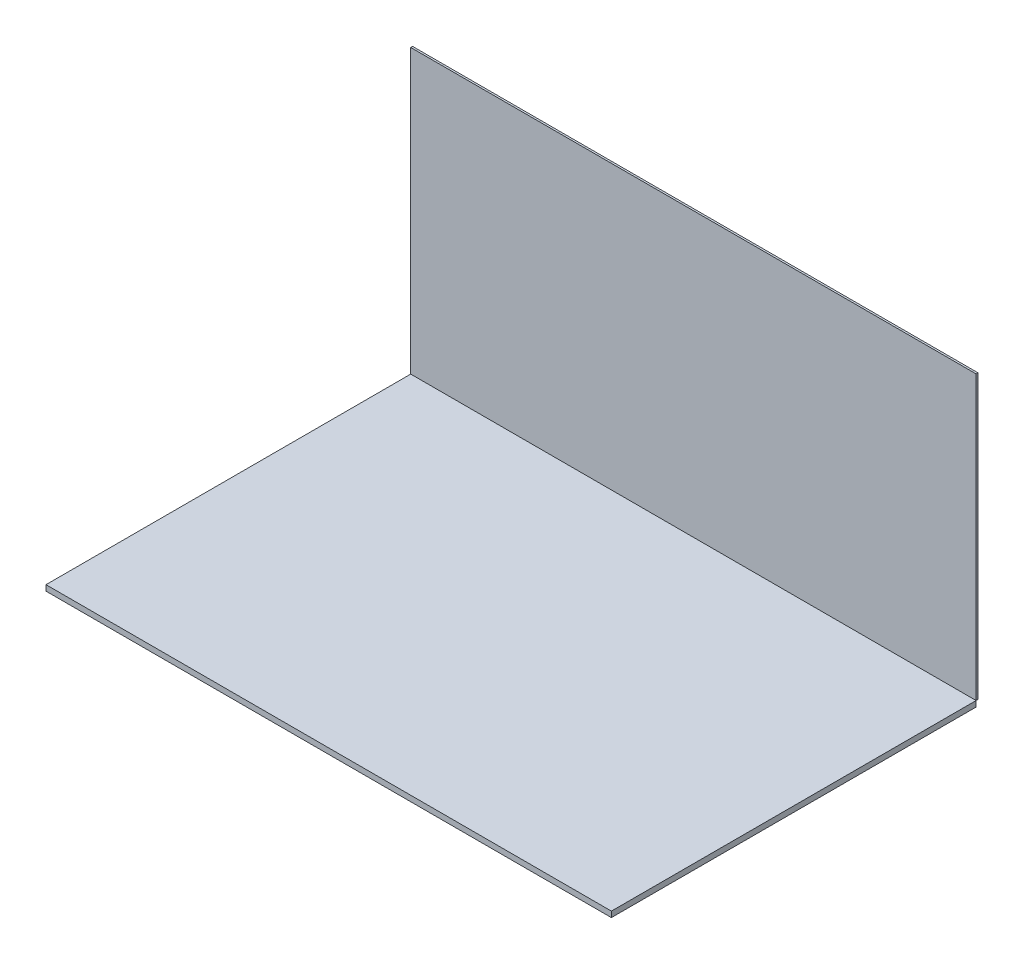
ISO-10303-21;
HEADER;
FILE_DESCRIPTION(('STEP AP214'),'2;1');
FILE_NAME('part.step','',(''),(''),'','','');
FILE_SCHEMA(('AUTOMOTIVE_DESIGN { 1 0 10303 214 1 1 1 1 }'));
ENDSEC;
DATA;
#1=APPLICATION_CONTEXT('core data for automotive mechanical design processes');
#2=APPLICATION_PROTOCOL_DEFINITION('international standard','automotive_design',2000,#1);
#3=PRODUCT_CONTEXT('',#1,'mechanical');
#4=PRODUCT('Part','Part','',(#3));
#5=PRODUCT_RELATED_PRODUCT_CATEGORY('part','',(#4));
#6=PRODUCT_DEFINITION_FORMATION('','',#4);
#7=PRODUCT_DEFINITION_CONTEXT('part definition',#1,'design');
#8=PRODUCT_DEFINITION('design','',#6,#7);
#9=PRODUCT_DEFINITION_SHAPE('','',#8);
#10=(LENGTH_UNIT() NAMED_UNIT(*) SI_UNIT(.MILLI.,.METRE.));
#11=(NAMED_UNIT(*) PLANE_ANGLE_UNIT() SI_UNIT($,.RADIAN.));
#12=(NAMED_UNIT(*) SI_UNIT($,.STERADIAN.) SOLID_ANGLE_UNIT());
#13=UNCERTAINTY_MEASURE_WITH_UNIT(LENGTH_MEASURE(1.E-05),#10,'distance_accuracy_value','');
#14=(GEOMETRIC_REPRESENTATION_CONTEXT(3) GLOBAL_UNCERTAINTY_ASSIGNED_CONTEXT((#13)) GLOBAL_UNIT_ASSIGNED_CONTEXT((#10,
#11,#12)) REPRESENTATION_CONTEXT('',''));
#15=CARTESIAN_POINT('',(0.,0.,0.));
#16=DIRECTION('',(0.,0.,1.));
#17=DIRECTION('',(1.,0.,0.));
#18=AXIS2_PLACEMENT_3D('',#15,#16,#17);
#19=CARTESIAN_POINT('',(15.512687992324,38.862,-20.3499821718743));
#20=DIRECTION('',(0.,0.,1.));
#21=DIRECTION('',(1.,0.,0.));
#22=AXIS2_PLACEMENT_3D('',#19,#20,#21);
#23=PLANE('',#22);
#24=DIRECTION('',(1.,0.,0.));
#25=VECTOR('',#24,1.);
#26=CARTESIAN_POINT('',(15.512687992324,0.762,-20.3499821718743));
#27=LINE('',#26,#25);
#28=CARTESIAN_POINT('',(15.512687992324,0.762,-20.3499821718743));
#29=VERTEX_POINT('',#28);
#30=CARTESIAN_POINT('',(-60.6405076063575,0.762,-20.3499821718743));
#31=VERTEX_POINT('',#30);
#32=EDGE_CURVE('E113',#29,#31,#27,.F.);
#33=ORIENTED_EDGE('',*,*,#32,.T.);
#34=DIRECTION('',(0.,-1.,0.));
#35=VECTOR('',#34,1.);
#36=CARTESIAN_POINT('',(-60.6405076063575,38.862,-20.3499821718743));
#37=LINE('',#36,#35);
#38=CARTESIAN_POINT('',(-60.6405076063575,38.862,-20.3499821718743));
#39=VERTEX_POINT('',#38);
#40=EDGE_CURVE('E12',#39,#31,#37,.T.);
#41=ORIENTED_EDGE('',*,*,#40,.F.);
#42=DIRECTION('',(1.,0.,0.));
#43=VECTOR('',#42,1.);
#44=CARTESIAN_POINT('',(15.512687992324,38.862,-20.3499821718743));
#45=LINE('',#44,#43);
#46=CARTESIAN_POINT('',(15.512687992324,38.862,-20.3499821718743));
#47=VERTEX_POINT('',#46);
#48=EDGE_CURVE('E90',#47,#39,#45,.F.);
#49=ORIENTED_EDGE('',*,*,#48,.F.);
#50=DIRECTION('',(0.,-1.,0.));
#51=VECTOR('',#50,1.);
#52=CARTESIAN_POINT('',(15.512687992324,38.862,-20.3499821718743));
#53=LINE('',#52,#51);
#54=EDGE_CURVE('E66',#47,#29,#53,.T.);
#55=ORIENTED_EDGE('',*,*,#54,.T.);
#56=EDGE_LOOP('',(#33,#41,#49,#55));
#57=FACE_BOUND('',#56,.T.);
#58=ADVANCED_FACE('F50',(#57),#23,.F.);
#59=CARTESIAN_POINT('',(-60.6405076063575,38.862,-20.0959821718743));
#60=DIRECTION('',(-1.,0.,0.));
#61=DIRECTION('',(0.,0.,1.));
#62=AXIS2_PLACEMENT_3D('',#59,#60,#61);
#63=PLANE('',#62);
#64=DIRECTION('',(0.,0.,-1.));
#65=VECTOR('',#64,1.);
#66=CARTESIAN_POINT('',(-60.6405076063575,0.762,-20.0959821718743));
#67=LINE('',#66,#65);
#68=CARTESIAN_POINT('',(-60.6405076063575,0.762,-20.0959821718743));
#69=VERTEX_POINT('',#68);
#70=EDGE_CURVE('E99',#69,#31,#67,.T.);
#71=ORIENTED_EDGE('',*,*,#70,.F.);
#72=DIRECTION('',(0.,-1.,0.));
#73=VECTOR('',#72,1.);
#74=CARTESIAN_POINT('',(-60.6405076063575,38.862,-20.0959821718743));
#75=LINE('',#74,#73);
#76=CARTESIAN_POINT('',(-60.6405076063575,38.862,-20.0959821718743));
#77=VERTEX_POINT('',#76);
#78=EDGE_CURVE('E58',#77,#69,#75,.T.);
#79=ORIENTED_EDGE('',*,*,#78,.F.);
#80=DIRECTION('',(0.,0.,-1.));
#81=VECTOR('',#80,1.);
#82=CARTESIAN_POINT('',(-60.6405076063575,38.862,-20.0959821718743));
#83=LINE('',#82,#81);
#84=EDGE_CURVE('E97',#77,#39,#83,.T.);
#85=ORIENTED_EDGE('',*,*,#84,.T.);
#86=ORIENTED_EDGE('',*,*,#40,.T.);
#87=EDGE_LOOP('',(#71,#79,#85,#86));
#88=FACE_BOUND('',#87,.T.);
#89=ADVANCED_FACE('F96',(#88),#63,.T.);
#90=CARTESIAN_POINT('',(15.512687992324,38.862,-20.0959821718743));
#91=DIRECTION('',(0.,0.,1.));
#92=DIRECTION('',(1.,0.,0.));
#93=AXIS2_PLACEMENT_3D('',#90,#91,#92);
#94=PLANE('',#93);
#95=DIRECTION('',(-1.,0.,0.));
#96=VECTOR('',#95,1.);
#97=CARTESIAN_POINT('',(15.512687992324,0.762,-20.0959821718743));
#98=LINE('',#97,#96);
#99=CARTESIAN_POINT('',(15.512687992324,0.762,-20.0959821718743));
#100=VERTEX_POINT('',#99);
#101=EDGE_CURVE('E116',#100,#69,#98,.T.);
#102=ORIENTED_EDGE('',*,*,#101,.F.);
#103=DIRECTION('',(0.,-1.,0.));
#104=VECTOR('',#103,1.);
#105=CARTESIAN_POINT('',(15.512687992324,38.862,-20.0959821718743));
#106=LINE('',#105,#104);
#107=CARTESIAN_POINT('',(15.512687992324,38.862,-20.0959821718743));
#108=VERTEX_POINT('',#107);
#109=EDGE_CURVE('E79',#108,#100,#106,.T.);
#110=ORIENTED_EDGE('',*,*,#109,.F.);
#111=DIRECTION('',(-1.,0.,0.));
#112=VECTOR('',#111,1.);
#113=CARTESIAN_POINT('',(15.512687992324,38.862,-20.0959821718743));
#114=LINE('',#113,#112);
#115=EDGE_CURVE('E105',#108,#77,#114,.T.);
#116=ORIENTED_EDGE('',*,*,#115,.T.);
#117=ORIENTED_EDGE('',*,*,#78,.T.);
#118=EDGE_LOOP('',(#102,#110,#116,#117));
#119=FACE_BOUND('',#118,.T.);
#120=ADVANCED_FACE('F107',(#119),#94,.T.);
#121=CARTESIAN_POINT('',(15.512687992324,38.862,-20.3499821718743));
#122=DIRECTION('',(1.,0.,0.));
#123=DIRECTION('',(0.,0.,-1.));
#124=AXIS2_PLACEMENT_3D('',#121,#122,#123);
#125=PLANE('',#124);
#126=DIRECTION('',(0.,0.,1.));
#127=VECTOR('',#126,1.);
#128=CARTESIAN_POINT('',(15.512687992324,0.762,-20.3499821718743));
#129=LINE('',#128,#127);
#130=EDGE_CURVE('E118',#29,#100,#129,.T.);
#131=ORIENTED_EDGE('',*,*,#130,.F.);
#132=ORIENTED_EDGE('',*,*,#54,.F.);
#133=DIRECTION('',(0.,0.,1.));
#134=VECTOR('',#133,1.);
#135=CARTESIAN_POINT('',(15.512687992324,38.862,-20.3499821718743));
#136=LINE('',#135,#134);
#137=EDGE_CURVE('E108',#47,#108,#136,.T.);
#138=ORIENTED_EDGE('',*,*,#137,.T.);
#139=ORIENTED_EDGE('',*,*,#109,.T.);
#140=EDGE_LOOP('',(#131,#132,#138,#139));
#141=FACE_BOUND('',#140,.T.);
#142=ADVANCED_FACE('F126',(#141),#125,.T.);
#143=CARTESIAN_POINT('',(0.,38.862,0.));
#144=DIRECTION('',(0.,1.,0.));
#145=DIRECTION('',(1.,0.,0.));
#146=AXIS2_PLACEMENT_3D('',#143,#144,#145);
#147=PLANE('',#146);
#148=ORIENTED_EDGE('',*,*,#48,.T.);
#149=ORIENTED_EDGE('',*,*,#84,.F.);
#150=ORIENTED_EDGE('',*,*,#115,.F.);
#151=ORIENTED_EDGE('',*,*,#137,.F.);
#152=EDGE_LOOP('',(#148,#149,#150,#151));
#153=FACE_BOUND('',#152,.T.);
#154=ADVANCED_FACE('F104',(#153),#147,.T.);
#155=CARTESIAN_POINT('',(0.,0.762,0.));
#156=DIRECTION('',(0.,1.,0.));
#157=DIRECTION('',(1.,0.,0.));
#158=AXIS2_PLACEMENT_3D('',#155,#156,#157);
#159=PLANE('',#158);
#160=ORIENTED_EDGE('',*,*,#32,.F.);
#161=ORIENTED_EDGE('',*,*,#130,.T.);
#162=ORIENTED_EDGE('',*,*,#101,.T.);
#163=ORIENTED_EDGE('',*,*,#70,.T.);
#164=EDGE_LOOP('',(#160,#161,#162,#163));
#165=FACE_BOUND('',#164,.T.);
#166=ADVANCED_FACE('F125',(#165),#159,.F.);
#167=CLOSED_SHELL('',(#58,#89,#120,#142,#154,#166));
#168=MANIFOLD_SOLID_BREP('B2',#167);
#169=CARTESIAN_POINT('',(-60.6405076063575,0.762,-20.0959821718743));
#170=DIRECTION('',(1.,0.,0.));
#171=DIRECTION('',(0.,0.,-1.));
#172=AXIS2_PLACEMENT_3D('',#169,#170,#171);
#173=PLANE('',#172);
#174=DIRECTION('',(0.,0.,1.));
#175=VECTOR('',#174,1.);
#176=CARTESIAN_POINT('',(-60.6405076063575,0.,-20.0959821718743));
#177=LINE('',#176,#175);
#178=CARTESIAN_POINT('',(-60.6405076063575,0.,-20.0959821718743));
#179=VERTEX_POINT('',#178);
#180=CARTESIAN_POINT('',(-60.6405076063575,0.,29.0275298038184));
#181=VERTEX_POINT('',#180);
#182=EDGE_CURVE('E251',#179,#181,#177,.T.);
#183=ORIENTED_EDGE('',*,*,#182,.T.);
#184=DIRECTION('',(0.,-1.,0.));
#185=VECTOR('',#184,1.);
#186=CARTESIAN_POINT('',(-60.6405076063575,0.762,29.0275298038184));
#187=LINE('',#186,#185);
#188=CARTESIAN_POINT('',(-60.6405076063575,0.762,29.0275298038184));
#189=VERTEX_POINT('',#188);
#190=EDGE_CURVE('E48',#189,#181,#187,.T.);
#191=ORIENTED_EDGE('',*,*,#190,.F.);
#192=DIRECTION('',(0.,0.,1.));
#193=VECTOR('',#192,1.);
#194=CARTESIAN_POINT('',(-60.6405076063575,0.762,-20.0959821718743));
#195=LINE('',#194,#193);
#196=CARTESIAN_POINT('',(-60.6405076063575,0.762,-20.0959821718743));
#197=VERTEX_POINT('',#196);
#198=EDGE_CURVE('E238',#197,#189,#195,.T.);
#199=ORIENTED_EDGE('',*,*,#198,.F.);
#200=DIRECTION('',(0.,-1.,0.));
#201=VECTOR('',#200,1.);
#202=CARTESIAN_POINT('',(-60.6405076063575,0.762,-20.0959821718743));
#203=LINE('',#202,#201);
#204=EDGE_CURVE('E247',#197,#179,#203,.T.);
#205=ORIENTED_EDGE('',*,*,#204,.T.);
#206=EDGE_LOOP('',(#183,#191,#199,#205));
#207=FACE_BOUND('',#206,.T.);
#208=ADVANCED_FACE('F187',(#207),#173,.F.);
#209=CARTESIAN_POINT('',(-60.6405076063575,0.762,29.0275298038184));
#210=DIRECTION('',(0.,0.,-1.));
#211=DIRECTION('',(-1.,0.,0.));
#212=AXIS2_PLACEMENT_3D('',#209,#210,#211);
#213=PLANE('',#212);
#214=DIRECTION('',(1.,0.,0.));
#215=VECTOR('',#214,1.);
#216=CARTESIAN_POINT('',(-60.6405076063575,0.,29.0275298038184));
#217=LINE('',#216,#215);
#218=CARTESIAN_POINT('',(15.512687992324,0.,29.0275298038184));
#219=VERTEX_POINT('',#218);
#220=EDGE_CURVE('E243',#181,#219,#217,.T.);
#221=ORIENTED_EDGE('',*,*,#220,.T.);
#222=DIRECTION('',(0.,-1.,0.));
#223=VECTOR('',#222,1.);
#224=CARTESIAN_POINT('',(15.512687992324,0.762,29.0275298038184));
#225=LINE('',#224,#223);
#226=CARTESIAN_POINT('',(15.512687992324,0.762,29.0275298038184));
#227=VERTEX_POINT('',#226);
#228=EDGE_CURVE('E195',#227,#219,#225,.T.);
#229=ORIENTED_EDGE('',*,*,#228,.F.);
#230=DIRECTION('',(1.,0.,0.));
#231=VECTOR('',#230,1.);
#232=CARTESIAN_POINT('',(-60.6405076063575,0.762,29.0275298038184));
#233=LINE('',#232,#231);
#234=EDGE_CURVE('E233',#189,#227,#233,.T.);
#235=ORIENTED_EDGE('',*,*,#234,.F.);
#236=ORIENTED_EDGE('',*,*,#190,.T.);
#237=EDGE_LOOP('',(#221,#229,#235,#236));
#238=FACE_BOUND('',#237,.T.);
#239=ADVANCED_FACE('F242',(#238),#213,.F.);
#240=CARTESIAN_POINT('',(15.512687992324,0.762,-20.0959821718743));
#241=DIRECTION('',(-1.,0.,0.));
#242=DIRECTION('',(0.,0.,1.));
#243=AXIS2_PLACEMENT_3D('',#240,#241,#242);
#244=PLANE('',#243);
#245=DIRECTION('',(0.,0.,-1.));
#246=VECTOR('',#245,1.);
#247=CARTESIAN_POINT('',(15.512687992324,0.,-20.0959821718743));
#248=LINE('',#247,#246);
#249=CARTESIAN_POINT('',(15.512687992324,0.,-20.0959821718743));
#250=VERTEX_POINT('',#249);
#251=EDGE_CURVE('E220',#219,#250,#248,.T.);
#252=ORIENTED_EDGE('',*,*,#251,.T.);
#253=DIRECTION('',(0.,-1.,0.));
#254=VECTOR('',#253,1.);
#255=CARTESIAN_POINT('',(15.512687992324,0.762,-20.0959821718743));
#256=LINE('',#255,#254);
#257=CARTESIAN_POINT('',(15.512687992324,0.762,-20.0959821718743));
#258=VERTEX_POINT('',#257);
#259=EDGE_CURVE('E244',#258,#250,#256,.T.);
#260=ORIENTED_EDGE('',*,*,#259,.F.);
#261=DIRECTION('',(0.,0.,-1.));
#262=VECTOR('',#261,1.);
#263=CARTESIAN_POINT('',(15.512687992324,0.762,-20.0959821718743));
#264=LINE('',#263,#262);
#265=EDGE_CURVE('E236',#227,#258,#264,.T.);
#266=ORIENTED_EDGE('',*,*,#265,.F.);
#267=ORIENTED_EDGE('',*,*,#228,.T.);
#268=EDGE_LOOP('',(#252,#260,#266,#267));
#269=FACE_BOUND('',#268,.T.);
#270=ADVANCED_FACE('F245',(#269),#244,.F.);
#271=CARTESIAN_POINT('',(-60.6405076063575,0.762,-20.0959821718743));
#272=DIRECTION('',(0.,0.,1.));
#273=DIRECTION('',(1.,0.,0.));
#274=AXIS2_PLACEMENT_3D('',#271,#272,#273);
#275=PLANE('',#274);
#276=DIRECTION('',(-1.,0.,0.));
#277=VECTOR('',#276,1.);
#278=CARTESIAN_POINT('',(-60.6405076063575,0.,-20.0959821718743));
#279=LINE('',#278,#277);
#280=EDGE_CURVE('E226',#250,#179,#279,.T.);
#281=ORIENTED_EDGE('',*,*,#280,.T.);
#282=ORIENTED_EDGE('',*,*,#204,.F.);
#283=DIRECTION('',(-1.,0.,0.));
#284=VECTOR('',#283,1.);
#285=CARTESIAN_POINT('',(-60.6405076063575,0.762,-20.0959821718743));
#286=LINE('',#285,#284);
#287=EDGE_CURVE('E203',#258,#197,#286,.T.);
#288=ORIENTED_EDGE('',*,*,#287,.F.);
#289=ORIENTED_EDGE('',*,*,#259,.T.);
#290=EDGE_LOOP('',(#281,#282,#288,#289));
#291=FACE_BOUND('',#290,.T.);
#292=ADVANCED_FACE('F258',(#291),#275,.F.);
#293=CARTESIAN_POINT('',(0.,0.762,0.));
#294=DIRECTION('',(0.,1.,0.));
#295=DIRECTION('',(0.,0.,1.));
#296=AXIS2_PLACEMENT_3D('',#293,#294,#295);
#297=PLANE('',#296);
#298=ORIENTED_EDGE('',*,*,#198,.T.);
#299=ORIENTED_EDGE('',*,*,#234,.T.);
#300=ORIENTED_EDGE('',*,*,#265,.T.);
#301=ORIENTED_EDGE('',*,*,#287,.T.);
#302=EDGE_LOOP('',(#298,#299,#300,#301));
#303=FACE_BOUND('',#302,.T.);
#304=ADVANCED_FACE('F234',(#303),#297,.T.);
#305=CARTESIAN_POINT('',(0.,0.,0.));
#306=DIRECTION('',(0.,1.,0.));
#307=DIRECTION('',(0.,0.,1.));
#308=AXIS2_PLACEMENT_3D('',#305,#306,#307);
#309=PLANE('',#308);
#310=ORIENTED_EDGE('',*,*,#182,.F.);
#311=ORIENTED_EDGE('',*,*,#280,.F.);
#312=ORIENTED_EDGE('',*,*,#251,.F.);
#313=ORIENTED_EDGE('',*,*,#220,.F.);
#314=EDGE_LOOP('',(#310,#311,#312,#313));
#315=FACE_BOUND('',#314,.T.);
#316=ADVANCED_FACE('F261',(#315),#309,.F.);
#317=CLOSED_SHELL('',(#208,#239,#270,#292,#304,#316));
#318=MANIFOLD_SOLID_BREP('B6',#317);
#319=ADVANCED_BREP_SHAPE_REPRESENTATION('',(#18,#168,#318),#14);
#320=SHAPE_DEFINITION_REPRESENTATION(#9,#319);
ENDSEC;
END-ISO-10303-21;
